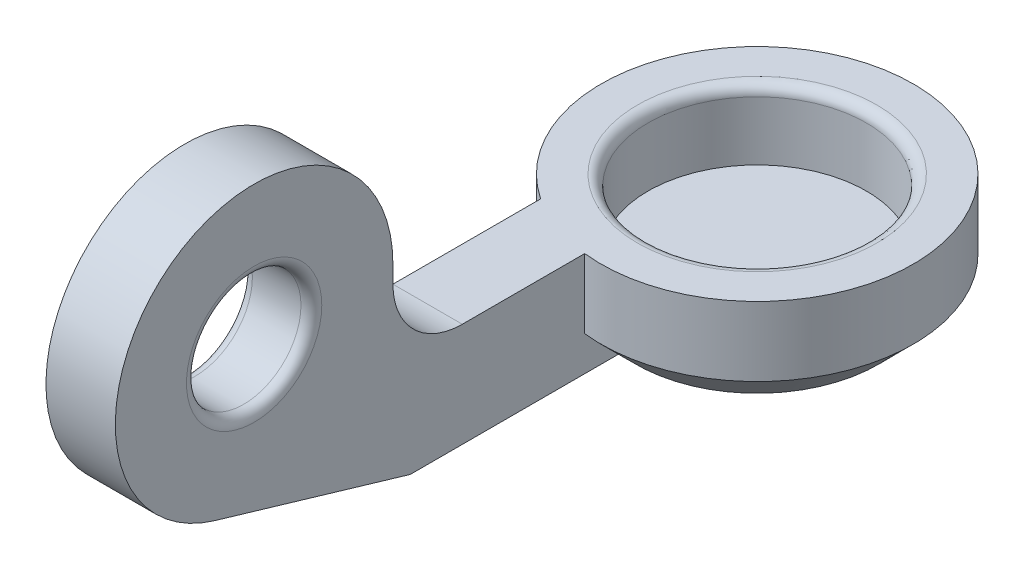
ISO-10303-21;
HEADER;
FILE_DESCRIPTION(('STEP AP214'),'2;1');
FILE_NAME('part.step','',(''),(''),'','','');
FILE_SCHEMA(('AUTOMOTIVE_DESIGN { 1 0 10303 214 1 1 1 1 }'));
ENDSEC;
DATA;
#1=APPLICATION_CONTEXT('core data for automotive mechanical design processes');
#2=APPLICATION_PROTOCOL_DEFINITION('international standard','automotive_design',2000,#1);
#3=PRODUCT_CONTEXT('',#1,'mechanical');
#4=PRODUCT('Part','Part','',(#3));
#5=PRODUCT_RELATED_PRODUCT_CATEGORY('part','',(#4));
#6=PRODUCT_DEFINITION_FORMATION('','',#4);
#7=PRODUCT_DEFINITION_CONTEXT('part definition',#1,'design');
#8=PRODUCT_DEFINITION('design','',#6,#7);
#9=PRODUCT_DEFINITION_SHAPE('','',#8);
#10=(LENGTH_UNIT() NAMED_UNIT(*) SI_UNIT(.MILLI.,.METRE.));
#11=(NAMED_UNIT(*) PLANE_ANGLE_UNIT() SI_UNIT($,.RADIAN.));
#12=(NAMED_UNIT(*) SI_UNIT($,.STERADIAN.) SOLID_ANGLE_UNIT());
#13=UNCERTAINTY_MEASURE_WITH_UNIT(LENGTH_MEASURE(1.E-05),#10,'distance_accuracy_value','');
#14=(GEOMETRIC_REPRESENTATION_CONTEXT(3) GLOBAL_UNCERTAINTY_ASSIGNED_CONTEXT((#13)) GLOBAL_UNIT_ASSIGNED_CONTEXT((#10,
#11,#12)) REPRESENTATION_CONTEXT('',''));
#15=CARTESIAN_POINT('',(0.,0.,0.));
#16=DIRECTION('',(0.,0.,1.));
#17=DIRECTION('',(1.,0.,0.));
#18=AXIS2_PLACEMENT_3D('',#15,#16,#17);
#19=CARTESIAN_POINT('',(0.,-2.,0.));
#20=DIRECTION('',(0.,1.,0.));
#21=DIRECTION('',(0.,0.,1.));
#22=AXIS2_PLACEMENT_3D('',#19,#20,#21);
#23=CONICAL_SURFACE('',#22,4.5,0.785398163397448);
#24=CARTESIAN_POINT('',(-0.5,1.84455672578068,-8.32956343092311));
#25=CARTESIAN_POINT('',(-0.5,1.56050708483777,-8.04499841482449));
#26=CARTESIAN_POINT('',(-0.5,1.27647978357437,-7.76041108292257));
#27=CARTESIAN_POINT('',(-0.5,0.708494530276033,-7.19115924221696));
#28=CARTESIAN_POINT('',(-0.5,0.424536579272096,-6.9064947323846));
#29=CARTESIAN_POINT('',(-0.5,-0.143366592922138,-6.33697445829595));
#30=CARTESIAN_POINT('',(-0.5,-0.427311782030489,-6.0521186620469));
#31=CARTESIAN_POINT('',(-0.5,-0.99504439296968,-5.48225763399936));
#32=CARTESIAN_POINT('',(-0.5,-1.27883181691005,-5.19725240430306));
#33=CARTESIAN_POINT('',(-0.5,-1.85350048784624,-4.61961401126448));
#34=CARTESIAN_POINT('',(-0.5,-2.14437521348103,-4.32697435992691));
#35=CARTESIAN_POINT('',(-0.5,-2.72568264848801,-3.74123232923193));
#36=CARTESIAN_POINT('',(-0.5,-3.01611533948948,-3.44812993162163));
#37=CARTESIAN_POINT('',(-0.5,-3.45101484407144,-3.00779367353851));
#38=CARTESIAN_POINT('',(-0.5,-3.5958419470033,-2.86091589775715));
#39=CARTESIAN_POINT('',(-0.5,-3.88511250907444,-2.5667782458169));
#40=CARTESIAN_POINT('',(-0.5,-4.02955596186184,-2.41951836341051));
#41=CARTESIAN_POINT('',(-0.5,-4.31779936005582,-2.12438992089171));
#42=CARTESIAN_POINT('',(-0.5,-4.46159935309042,-1.9765214074385));
#43=CARTESIAN_POINT('',(-0.5,-4.67638345410784,-1.75383844803434));
#44=CARTESIAN_POINT('',(-0.5,-4.7478245591479,-1.67946509501682));
#45=CARTESIAN_POINT('',(-0.5,-4.89025485207228,-1.53028723892495));
#46=CARTESIAN_POINT('',(-0.5,-4.96124404443078,-1.4554827401332));
#47=CARTESIAN_POINT('',(-0.5,-5.07000750791339,-1.33980093696933));
#48=CARTESIAN_POINT('',(-0.5,-5.10802939419686,-1.29915655648828));
#49=CARTESIAN_POINT('',(-0.5,-5.18380610610896,-1.21761815713421));
#50=CARTESIAN_POINT('',(-0.5,-5.22156092781463,-1.17672413461052));
#51=CARTESIAN_POINT('',(-0.5,-5.29663063086563,-1.09470121937531));
#52=CARTESIAN_POINT('',(-0.5,-5.33394630544709,-1.0535730536634));
#53=CARTESIAN_POINT('',(-0.5,-5.4080886195102,-0.970879040266312));
#54=CARTESIAN_POINT('',(-0.5,-5.44491527362126,-0.929313205741325));
#55=CARTESIAN_POINT('',(-0.5,-5.52762414048717,-0.834384107956916));
#56=CARTESIAN_POINT('',(-0.5,-5.57329582917367,-0.780837081168954));
#57=CARTESIAN_POINT('',(-0.5,-5.66298120195017,-0.671994253754087));
#58=CARTESIAN_POINT('',(-0.5,-5.70698786566927,-0.616692540626108));
#59=CARTESIAN_POINT('',(-0.5,-5.77053081956287,-0.531487144997089));
#60=CARTESIAN_POINT('',(-0.5,-5.79138824788977,-0.502575514403177));
#61=CARTESIAN_POINT('',(-0.5,-5.83179128884024,-0.4438042162966));
#62=CARTESIAN_POINT('',(-0.5,-5.85133580834869,-0.413943788558022));
#63=CARTESIAN_POINT('',(-0.5,-5.88834818027311,-0.353126256983285));
#64=CARTESIAN_POINT('',(-0.5,-5.90582507990371,-0.322174763370816));
#65=CARTESIAN_POINT('',(-0.5,-5.93768505638904,-0.258745893671859));
#66=CARTESIAN_POINT('',(-0.5,-5.95207398030669,-0.226271545814342));
#67=CARTESIAN_POINT('',(-0.5,-5.97621978956839,-0.159155788096467));
#68=CARTESIAN_POINT('',(-0.5,-5.98592616732087,-0.124495118782898));
#69=CARTESIAN_POINT('',(-0.5,-5.99825618722708,-0.0540707572158387));
#70=CARTESIAN_POINT('',(-0.5,-6.00092668456852,-0.0183159743105536));
#71=CARTESIAN_POINT('',(-0.5,-5.99847296288625,0.0529727404849206));
#72=CARTESIAN_POINT('',(-0.5,-5.99333303669486,0.0885060826566771));
#73=CARTESIAN_POINT('',(-0.5,-5.97668577394989,0.158195198760665));
#74=CARTESIAN_POINT('',(-0.5,-5.96513274108427,0.192339176893906));
#75=CARTESIAN_POINT('',(-0.5,-5.93480061320678,0.266130071703718));
#76=CARTESIAN_POINT('',(-0.5,-5.91499056608467,0.305333351929589));
#77=CARTESIAN_POINT('',(-0.5,-5.87173301819547,0.381718062786176));
#78=CARTESIAN_POINT('',(-0.5,-5.84827634554093,0.418894066949211));
#79=CARTESIAN_POINT('',(-0.5,-5.79904777256703,0.492002214262168));
#80=CARTESIAN_POINT('',(-0.5,-5.77326208689647,0.527924934770371));
#81=CARTESIAN_POINT('',(-0.5,-5.72034083480357,0.598677113662614));
#82=CARTESIAN_POINT('',(-0.5,-5.693207038772,0.633507912775811));
#83=CARTESIAN_POINT('',(-0.5,-5.61526342578271,0.730888910563142));
#84=CARTESIAN_POINT('',(-0.5,-5.56339737759493,0.792588848604165));
#85=CARTESIAN_POINT('',(-0.5,-5.45807538778561,0.914622329290568));
#86=CARTESIAN_POINT('',(-0.5,-5.40461902580731,0.974955503110521));
#87=CARTESIAN_POINT('',(-0.5,-5.29669100088894,1.09482119858602));
#88=CARTESIAN_POINT('',(-0.5,-5.2422183237578,1.15435280578165));
#89=CARTESIAN_POINT('',(-0.5,-5.1326630069678,1.27283652130572));
#90=CARTESIAN_POINT('',(-0.5,-5.07758044090649,1.33178869796985));
#91=CARTESIAN_POINT('',(-0.5,-4.91224351989638,1.50750201236674));
#92=CARTESIAN_POINT('',(-0.5,-4.80137950667479,1.62368876701915));
#93=CARTESIAN_POINT('',(-0.5,-4.57886581880136,1.85519380298763));
#94=CARTESIAN_POINT('',(-0.5,-4.46721655566742,1.97051248189618));
#95=CARTESIAN_POINT('',(-0.5,-4.20942801301285,2.23561094395497));
#96=CARTESIAN_POINT('',(-0.5,-4.06311268923825,2.3852194961621));
#97=CARTESIAN_POINT('',(-0.5,-3.76998412402506,2.68399035736643));
#98=CARTESIAN_POINT('',(-0.5,-3.62317081235265,2.83315259731562));
#99=CARTESIAN_POINT('',(-0.5,-3.32909014568224,3.1313379525699));
#100=CARTESIAN_POINT('',(-0.5,-3.18182247577289,3.28036075725725));
#101=CARTESIAN_POINT('',(-0.5,-2.88709482362797,3.57820377206648));
#102=CARTESIAN_POINT('',(-0.5,-2.73963484959933,3.72702399031365));
#103=CARTESIAN_POINT('',(-0.5,-2.42510048872422,4.0441650280635));
#104=CARTESIAN_POINT('',(-0.5,-2.25800665731583,4.21246656038625));
#105=CARTESIAN_POINT('',(-0.5,-1.92369386295978,4.54894917647072));
#106=CARTESIAN_POINT('',(-0.5,-1.75647489857406,4.71713025880332));
#107=CARTESIAN_POINT('',(-0.5,-1.25481985182567,5.22140770810821));
#108=CARTESIAN_POINT('',(-0.5,-0.920251946824391,5.55737292667038));
#109=CARTESIAN_POINT('',(-0.5,-0.185731867548644,6.29453206406151));
#110=CARTESIAN_POINT('',(-0.5,0.214262034476446,6.69568438979152));
#111=CARTESIAN_POINT('',(-0.5,1.01459926683641,7.49799356471106));
#112=CARTESIAN_POINT('',(-0.5,1.41494267347706,7.89915033778905));
#113=CARTESIAN_POINT('',(-0.5,1.81531964439593,8.30027353696713));
#114=B_SPLINE_CURVE_WITH_KNOTS('',3,(#24,#25,#26,#27,#28,#29,#30,#31,#32,#33,#34,#35,#36,#37,
#38,#39,#40,#41,#42,#43,#44,#45,#46,#47,#48,#49,#50,#51,#52,#53,#54,#55,#56,#57,#58,#59,#60,#61,
#62,#63,#64,#65,#66,#67,#68,#69,#70,#71,#72,#73,#74,#75,#76,#77,#78,#79,#80,#81,#82,#83,#84,#85,
#86,#87,#88,#89,#90,#91,#92,#93,#94,#95,#96,#97,#98,#99,#100,#101,#102,#103,#104,#105,#106,#107,
#108,#109,#110,#111,#112,#113),.UNSPECIFIED.,.F.,.F.,(4,2,2,2,2,2,2,2,2,2,2,2,2,2,2,2,2,2,2,2,2,
2,2,2,2,2,2,2,2,2,2,2,2,2,2,2,2,2,2,2,2,2,2,2,4),(0.,1.20621435242465,2.41244566123549,
3.61905627978482,4.82565035643883,6.06347679806063,7.30135335025228,7.92016760723653,
8.53899204649839,9.15776989730009,9.46715056596943,9.77652816681766,9.94349636452863,
10.1104670098003,10.2770653596704,10.4436587143424,10.6547799123228,10.8667097318165,
10.9736349158873,11.0806480488248,11.1871741029436,11.2934966353278,11.4009416903207,
11.5076693888429,11.6146120065518,11.7223266062877,11.853757802166,11.9855250840214,
12.1181310144811,12.2505671816149,12.4923168125491,12.7341309214143,12.9762008266608,
13.2182418320816,13.700011127738,14.1815443966626,14.8093301583688,15.4372084829039,
16.0657461983655,16.6942579145561,17.4057434372674,18.1172372661971,19.5396557314697,
21.2391452464389,22.9393846734594),.UNSPECIFIED.);
#115=CARTESIAN_POINT('',(-0.5,-3.,3.46410161513775));
#116=VERTEX_POINT('',#115);
#117=CARTESIAN_POINT('',(-0.5,-2.,4.47213595499958));
#118=VERTEX_POINT('',#117);
#119=EDGE_CURVE('E196',#116,#118,#114,.T.);
#120=ORIENTED_EDGE('',*,*,#119,.F.);
#121=CARTESIAN_POINT('',(0.,-3.,0.));
#122=DIRECTION('',(0.,1.,0.));
#123=DIRECTION('',(0.,0.,1.));
#124=AXIS2_PLACEMENT_3D('',#121,#122,#123);
#125=CIRCLE('',#124,3.5);
#126=CARTESIAN_POINT('',(-2.5,-3.,2.44948974278318));
#127=VERTEX_POINT('',#126);
#128=EDGE_CURVE('E170',#116,#127,#125,.T.);
#129=ORIENTED_EDGE('',*,*,#128,.T.);
#130=CARTESIAN_POINT('',(-2.5,2.62537239341259,-8.77624186759097));
#131=CARTESIAN_POINT('',(-2.5,2.45532686204164,-8.59942389655475));
#132=CARTESIAN_POINT('',(-2.5,2.28547397593831,-8.42242013726825));
#133=CARTESIAN_POINT('',(-2.5,1.94624926182495,-8.0679493474952));
#134=CARTESIAN_POINT('',(-2.5,1.77687743805998,-7.89048231294689));
#135=CARTESIAN_POINT('',(-2.5,1.43866067607728,-7.53494073884856));
#136=CARTESIAN_POINT('',(-2.5,1.26981591941549,-7.35686602649842));
#137=CARTESIAN_POINT('',(-2.5,0.932841839792324,-7.00004182107414));
#138=CARTESIAN_POINT('',(-2.5,0.764712514228827,-6.82129233045872));
#139=CARTESIAN_POINT('',(-2.5,0.430766547477874,-6.46447546975868));
#140=CARTESIAN_POINT('',(-2.5,0.264942380185847,-6.286415148316));
#141=CARTESIAN_POINT('',(-2.5,-0.0655927638383192,-5.92926454193018));
#142=CARTESIAN_POINT('',(-2.5,-0.230303745247746,-5.75017426132048));
#143=CARTESIAN_POINT('',(-2.5,-0.558263151063855,-5.39070085892808));
#144=CARTESIAN_POINT('',(-2.5,-0.721511763612765,-5.21031790898999));
#145=CARTESIAN_POINT('',(-2.5,-1.04609776936607,-4.84784273816462));
#146=CARTESIAN_POINT('',(-2.5,-1.2074352023583,-4.66575055300296));
#147=CARTESIAN_POINT('',(-2.5,-1.48404599494157,-4.3490238571088));
#148=CARTESIAN_POINT('',(-2.5,-1.59993366034814,-4.21492644916895));
#149=CARTESIAN_POINT('',(-2.5,-1.82992756674574,-3.94519341122693));
#150=CARTESIAN_POINT('',(-2.5,-1.94403368734428,-3.80955767832861));
#151=CARTESIAN_POINT('',(-2.5,-2.17049957995706,-3.53561211597668));
#152=CARTESIAN_POINT('',(-2.5,-2.2828468187155,-3.39729189365955));
#153=CARTESIAN_POINT('',(-2.5,-2.50432038039213,-3.11812233830049));
#154=CARTESIAN_POINT('',(-2.5,-2.61344724512665,-2.9772734371875));
#155=CARTESIAN_POINT('',(-2.5,-2.82817074901362,-2.69098375461344));
#156=CARTESIAN_POINT('',(-2.5,-2.93372876691941,-2.54551382405584));
#157=CARTESIAN_POINT('',(-2.5,-3.13838703401993,-2.24985681163713));
#158=CARTESIAN_POINT('',(-2.5,-3.23748171553703,-2.09966582374475));
#159=CARTESIAN_POINT('',(-2.5,-3.4252732208908,-1.79400530737046));
#160=CARTESIAN_POINT('',(-2.5,-3.51402525687041,-1.63857011748645));
#161=CARTESIAN_POINT('',(-2.5,-3.67625211618313,-1.31995606951551));
#162=CARTESIAN_POINT('',(-2.5,-3.74975772041651,-1.15679364679773));
#163=CARTESIAN_POINT('',(-2.5,-3.83884070532115,-0.914632875530704));
#164=CARTESIAN_POINT('',(-2.5,-3.86393646429119,-0.83914148757603));
#165=CARTESIAN_POINT('',(-2.5,-3.90848771122169,-0.686489202153973));
#166=CARTESIAN_POINT('',(-2.5,-3.92794338394794,-0.609328359465924));
#167=CARTESIAN_POINT('',(-2.5,-3.96026154184952,-0.453897392597565));
#168=CARTESIAN_POINT('',(-2.5,-3.97314663196761,-0.375632036741169));
#169=CARTESIAN_POINT('',(-2.5,-3.99170800593505,-0.21824406017463));
#170=CARTESIAN_POINT('',(-2.5,-3.99738501867,-0.139121526959008));
#171=CARTESIAN_POINT('',(-2.5,-4.00119023636275,0.0197496047483457));
#172=CARTESIAN_POINT('',(-2.5,-3.99927622884941,0.0994992360076441));
#173=CARTESIAN_POINT('',(-2.5,-3.98792693941288,0.258456175830423));
#174=CARTESIAN_POINT('',(-2.5,-3.97849119012075,0.337663450385709));
#175=CARTESIAN_POINT('',(-2.5,-3.95262595988836,0.495147110585215));
#176=CARTESIAN_POINT('',(-2.5,-3.93617612628186,0.573420100386687));
#177=CARTESIAN_POINT('',(-2.5,-3.89712240856814,0.72842629456631));
#178=CARTESIAN_POINT('',(-2.5,-3.87451579881143,0.805158800768309));
#179=CARTESIAN_POINT('',(-2.5,-3.81383108482149,0.987746946736327));
#180=CARTESIAN_POINT('',(-2.5,-3.77320039781125,1.09275012656053));
#181=CARTESIAN_POINT('',(-2.5,-3.68404978504835,1.29933589908505));
#182=CARTESIAN_POINT('',(-2.5,-3.63552596619295,1.40091677381601));
#183=CARTESIAN_POINT('',(-2.5,-3.5324276106022,1.60121005826891));
#184=CARTESIAN_POINT('',(-2.5,-3.47784000593763,1.6999156707114));
#185=CARTESIAN_POINT('',(-2.5,-3.36416856068681,1.89464390025878));
#186=CARTESIAN_POINT('',(-2.5,-3.3050858396643,1.99066717733951));
#187=CARTESIAN_POINT('',(-2.5,-3.1495554604418,2.2334792524369));
#188=CARTESIAN_POINT('',(-2.5,-3.05065699098487,2.37869190466841));
#189=CARTESIAN_POINT('',(-2.5,-2.8472198362771,2.6651314028905));
#190=CARTESIAN_POINT('',(-2.5,-2.74267921630092,2.80635685603766));
#191=CARTESIAN_POINT('',(-2.5,-2.52952235646906,3.08591507615983));
#192=CARTESIAN_POINT('',(-2.5,-2.42090201378568,3.22424470076945));
#193=CARTESIAN_POINT('',(-2.5,-2.20076719402405,3.49858408373473));
#194=CARTESIAN_POINT('',(-2.5,-2.08925254686146,3.63459370497308));
#195=CARTESIAN_POINT('',(-2.5,-1.86388814878397,3.90501260292795));
#196=CARTESIAN_POINT('',(-2.5,-1.75003508548807,4.03941911200735));
#197=CARTESIAN_POINT('',(-2.5,-1.52065803564957,4.30680232898979));
#198=CARTESIAN_POINT('',(-2.5,-1.4051339996097,4.43977899433399));
#199=CARTESIAN_POINT('',(-2.5,-1.05677810194326,4.836828106147));
#200=CARTESIAN_POINT('',(-2.5,-0.822010003706293,5.09920042636675));
#201=CARTESIAN_POINT('',(-2.5,-0.357579597979248,5.61164109003173));
#202=CARTESIAN_POINT('',(-2.5,-0.12803306236707,5.86181493358573));
#203=CARTESIAN_POINT('',(-2.5,0.333262079894573,6.36021736148205));
#204=CARTESIAN_POINT('',(-2.5,0.565011127765062,6.60844553707359));
#205=CARTESIAN_POINT('',(-2.5,1.02860577757195,7.10190290541815));
#206=CARTESIAN_POINT('',(-2.5,1.26044176562337,7.34714114681969));
#207=CARTESIAN_POINT('',(-2.5,1.72522369193856,7.83645198023402));
#208=CARTESIAN_POINT('',(-2.5,1.95816935002065,8.08052483825432));
#209=CARTESIAN_POINT('',(-2.5,2.19151702101936,8.32420975989128));
#210=B_SPLINE_CURVE_WITH_KNOTS('',3,(#130,#131,#132,#133,#134,#135,#136,#137,#138,#139,#140,
#141,#142,#143,#144,#145,#146,#147,#148,#149,#150,#151,#152,#153,#154,#155,#156,#157,#158,#159,
#160,#161,#162,#163,#164,#165,#166,#167,#168,#169,#170,#171,#172,#173,#174,#175,#176,#177,#178,
#179,#180,#181,#182,#183,#184,#185,#186,#187,#188,#189,#190,#191,#192,#193,#194,#195,#196,#197,
#198,#199,#200,#201,#202,#203,#204,#205,#206,#207,#208,#209),.UNSPECIFIED.,.F.,.F.,(4,2,2,2,2,2,
2,2,2,2,2,2,2,2,2,2,2,2,2,2,2,2,2,2,2,2,2,2,2,2,2,2,2,2,2,2,2,2,2,4),(0.,0.735949258687007,
1.47190499160842,2.20809113399568,2.94427459648893,3.67422178378698,4.4041659021477,
5.13401471980858,5.8638483163357,6.39554008686045,6.92726763365697,7.46182634222686,
7.99629459443896,8.53537806862466,9.07491995126682,9.61143506907622,10.1468562450731,
10.385340198542,10.6238163385383,10.861466412123,11.0990924524591,11.3380417415312,
11.5770058790497,11.8166681852488,12.0564367646467,12.3937545516366,12.7312392200414,
13.0694658462401,13.407608507002,13.9344654352589,14.4615041879956,14.9890879543799,
15.516702794836,16.0451250757079,16.5735630416013,17.6297297364615,18.648296684882,
19.6670721704672,20.6794947128856,21.6916739092562),.UNSPECIFIED.);
#211=CARTESIAN_POINT('',(-2.5,-2.,3.74165738677394));
#212=VERTEX_POINT('',#211);
#213=EDGE_CURVE('E186',#127,#212,#210,.T.);
#214=ORIENTED_EDGE('',*,*,#213,.T.);
#215=CARTESIAN_POINT('',(0.,-2.,0.));
#216=DIRECTION('',(0.,1.,0.));
#217=DIRECTION('',(0.,0.,1.));
#218=AXIS2_PLACEMENT_3D('',#215,#216,#217);
#219=CIRCLE('',#218,4.5);
#220=EDGE_CURVE('E174',#118,#212,#219,.T.);
#221=ORIENTED_EDGE('',*,*,#220,.F.);
#222=EDGE_LOOP('',(#120,#129,#214,#221));
#223=FACE_BOUND('',#222,.T.);
#224=ADVANCED_FACE('F43',(#223),#23,.T.);
#225=CARTESIAN_POINT('',(0.,-3.,0.));
#226=DIRECTION('',(0.,1.,0.));
#227=DIRECTION('',(0.,0.,1.));
#228=AXIS2_PLACEMENT_3D('',#225,#226,#227);
#229=CYLINDRICAL_SURFACE('',#228,4.5);
#230=DIRECTION('',(0.,1.,0.));
#231=VECTOR('',#230,1.);
#232=CARTESIAN_POINT('',(-0.5,-3.,4.47213595499958));
#233=LINE('',#232,#231);
#234=CARTESIAN_POINT('',(-0.5,0.,4.47213595499958));
#235=VERTEX_POINT('',#234);
#236=EDGE_CURVE('E166',#118,#235,#233,.T.);
#237=ORIENTED_EDGE('',*,*,#236,.F.);
#238=ORIENTED_EDGE('',*,*,#220,.T.);
#239=DIRECTION('',(0.,1.,0.));
#240=VECTOR('',#239,1.);
#241=CARTESIAN_POINT('',(-2.5,-3.,3.74165738677394));
#242=LINE('',#241,#240);
#243=CARTESIAN_POINT('',(-2.5,0.,3.74165738677394));
#244=VERTEX_POINT('',#243);
#245=EDGE_CURVE('E162',#212,#244,#242,.T.);
#246=ORIENTED_EDGE('',*,*,#245,.T.);
#247=CARTESIAN_POINT('',(0.,0.,0.));
#248=DIRECTION('',(0.,1.,0.));
#249=DIRECTION('',(0.,0.,1.));
#250=AXIS2_PLACEMENT_3D('',#247,#248,#249);
#251=CIRCLE('',#250,4.5);
#252=EDGE_CURVE('E182',#235,#244,#251,.T.);
#253=ORIENTED_EDGE('',*,*,#252,.F.);
#254=EDGE_LOOP('',(#237,#238,#246,#253));
#255=FACE_BOUND('',#254,.T.);
#256=ADVANCED_FACE('F227',(#255),#229,.T.);
#257=CARTESIAN_POINT('',(0.,0.,0.));
#258=DIRECTION('',(0.,1.,0.));
#259=DIRECTION('',(0.,0.,1.));
#260=AXIS2_PLACEMENT_3D('',#257,#258,#259);
#261=PLANE('',#260);
#262=CARTESIAN_POINT('',(0.,0.,0.));
#263=DIRECTION('',(0.,1.,0.));
#264=DIRECTION('',(0.,0.,1.));
#265=AXIS2_PLACEMENT_3D('',#262,#263,#264);
#266=CIRCLE('',#265,3.45);
#267=CARTESIAN_POINT('',(0.,0.,3.45));
#268=VERTEX_POINT('',#267);
#269=EDGE_CURVE('E253',#268,#268,#266,.F.);
#270=ORIENTED_EDGE('',*,*,#269,.T.);
#271=EDGE_LOOP('',(#270));
#272=FACE_BOUND('',#271,.T.);
#273=DIRECTION('',(0.,0.,1.));
#274=VECTOR('',#273,1.);
#275=CARTESIAN_POINT('',(-2.5,0.,3.74165738677394));
#276=LINE('',#275,#274);
#277=CARTESIAN_POINT('',(-2.5,0.,8.));
#278=VERTEX_POINT('',#277);
#279=EDGE_CURVE('E122',#244,#278,#276,.T.);
#280=ORIENTED_EDGE('',*,*,#279,.T.);
#281=DIRECTION('',(-1.,0.,0.));
#282=VECTOR('',#281,1.);
#283=CARTESIAN_POINT('',(0.,0.,8.));
#284=LINE('',#283,#282);
#285=CARTESIAN_POINT('',(-0.5,0.,8.));
#286=VERTEX_POINT('',#285);
#287=EDGE_CURVE('E66',#278,#286,#284,.F.);
#288=ORIENTED_EDGE('',*,*,#287,.T.);
#289=DIRECTION('',(0.,0.,1.));
#290=VECTOR('',#289,1.);
#291=CARTESIAN_POINT('',(-0.5,0.,3.74165738677394));
#292=LINE('',#291,#290);
#293=EDGE_CURVE('E138',#235,#286,#292,.T.);
#294=ORIENTED_EDGE('',*,*,#293,.F.);
#295=ORIENTED_EDGE('',*,*,#252,.T.);
#296=EDGE_LOOP('',(#280,#288,#294,#295));
#297=FACE_BOUND('',#296,.T.);
#298=ADVANCED_FACE('F232',(#272,#297),#261,.T.);
#299=CARTESIAN_POINT('',(0.,-2.,0.));
#300=DIRECTION('',(0.,1.,0.));
#301=DIRECTION('',(0.,0.,1.));
#302=AXIS2_PLACEMENT_3D('',#299,#300,#301);
#303=CYLINDRICAL_SURFACE('',#302,3.15);
#304=CARTESIAN_POINT('',(0.,-0.3,0.));
#305=DIRECTION('',(0.,1.,0.));
#306=DIRECTION('',(0.,0.,1.));
#307=AXIS2_PLACEMENT_3D('',#304,#305,#306);
#308=CIRCLE('',#307,3.15);
#309=CARTESIAN_POINT('',(0.,-0.3,3.15));
#310=VERTEX_POINT('',#309);
#311=EDGE_CURVE('E248',#310,#310,#308,.T.);
#312=ORIENTED_EDGE('',*,*,#311,.T.);
#313=EDGE_LOOP('',(#312));
#314=FACE_BOUND('',#313,.T.);
#315=CARTESIAN_POINT('',(0.,-2.,0.));
#316=DIRECTION('',(0.,1.,0.));
#317=DIRECTION('',(0.,0.,1.));
#318=AXIS2_PLACEMENT_3D('',#315,#316,#317);
#319=CIRCLE('',#318,3.15);
#320=CARTESIAN_POINT('',(0.,-2.,3.15));
#321=VERTEX_POINT('',#320);
#322=EDGE_CURVE('E178',#321,#321,#319,.T.);
#323=ORIENTED_EDGE('',*,*,#322,.F.);
#324=EDGE_LOOP('',(#323));
#325=FACE_BOUND('',#324,.T.);
#326=ADVANCED_FACE('F346',(#314,#325),#303,.F.);
#327=CARTESIAN_POINT('',(0.,-2.,0.));
#328=DIRECTION('',(0.,1.,0.));
#329=DIRECTION('',(0.,0.,1.));
#330=AXIS2_PLACEMENT_3D('',#327,#328,#329);
#331=PLANE('',#330);
#332=ORIENTED_EDGE('',*,*,#322,.T.);
#333=EDGE_LOOP('',(#332));
#334=FACE_BOUND('',#333,.T.);
#335=ADVANCED_FACE('F222',(#334),#331,.T.);
#336=CARTESIAN_POINT('',(0.,-3.,0.));
#337=DIRECTION('',(0.,1.,0.));
#338=DIRECTION('',(0.,0.,1.));
#339=AXIS2_PLACEMENT_3D('',#336,#337,#338);
#340=PLANE('',#339);
#341=ORIENTED_EDGE('',*,*,#128,.F.);
#342=DIRECTION('',(0.,0.,-1.));
#343=VECTOR('',#342,1.);
#344=CARTESIAN_POINT('',(-0.5,-3.,3.5));
#345=LINE('',#344,#343);
#346=CARTESIAN_POINT('',(-0.5,-3.,9.5));
#347=VERTEX_POINT('',#346);
#348=EDGE_CURVE('E142',#347,#116,#345,.T.);
#349=ORIENTED_EDGE('',*,*,#348,.F.);
#350=DIRECTION('',(1.,0.,0.));
#351=VECTOR('',#350,1.);
#352=CARTESIAN_POINT('',(-15.3677365165916,-3.,9.5));
#353=LINE('',#352,#351);
#354=CARTESIAN_POINT('',(-2.5,-3.,9.5));
#355=VERTEX_POINT('',#354);
#356=EDGE_CURVE('E151',#355,#347,#353,.T.);
#357=ORIENTED_EDGE('',*,*,#356,.F.);
#358=DIRECTION('',(0.,0.,1.));
#359=VECTOR('',#358,1.);
#360=CARTESIAN_POINT('',(-2.5,-3.,3.5));
#361=LINE('',#360,#359);
#362=EDGE_CURVE('E150',#127,#355,#361,.T.);
#363=ORIENTED_EDGE('',*,*,#362,.F.);
#364=EDGE_LOOP('',(#341,#349,#357,#363));
#365=FACE_BOUND('',#364,.T.);
#366=ADVANCED_FACE('F217',(#365),#340,.F.);
#367=CARTESIAN_POINT('',(-15.3677365165916,-3.,9.5));
#368=DIRECTION('',(0.,-0.959039906535825,0.283270996877119));
#369=DIRECTION('',(0.,-0.283270996877119,-0.959039906535825));
#370=AXIS2_PLACEMENT_3D('',#367,#368,#369);
#371=PLANE('',#370);
#372=DIRECTION('',(0.,0.283270996877119,0.959039906535825));
#373=VECTOR('',#372,1.);
#374=CARTESIAN_POINT('',(-2.5,-3.,9.5));
#375=LINE('',#374,#373);
#376=CARTESIAN_POINT('',(-2.5,-1.3361596261433,15.1330839875085));
#377=VERTEX_POINT('',#376);
#378=EDGE_CURVE('E146',#355,#377,#375,.T.);
#379=ORIENTED_EDGE('',*,*,#378,.F.);
#380=ORIENTED_EDGE('',*,*,#356,.T.);
#381=DIRECTION('',(0.,-0.283270996877119,-0.959039906535825));
#382=VECTOR('',#381,1.);
#383=CARTESIAN_POINT('',(-0.5,-3.,9.5));
#384=LINE('',#383,#382);
#385=CARTESIAN_POINT('',(-0.5,-1.3361596261433,15.1330839875085));
#386=VERTEX_POINT('',#385);
#387=EDGE_CURVE('E132',#386,#347,#384,.T.);
#388=ORIENTED_EDGE('',*,*,#387,.F.);
#389=DIRECTION('',(1.,0.,0.));
#390=VECTOR('',#389,1.);
#391=CARTESIAN_POINT('',(-15.3677365165916,-1.3361596261433,15.1330839875085));
#392=LINE('',#391,#390);
#393=EDGE_CURVE('E131',#377,#386,#392,.T.);
#394=ORIENTED_EDGE('',*,*,#393,.F.);
#395=EDGE_LOOP('',(#379,#380,#388,#394));
#396=FACE_BOUND('',#395,.T.);
#397=ADVANCED_FACE('F214',(#396),#371,.T.);
#398=CARTESIAN_POINT('',(-0.5,0.,0.));
#399=DIRECTION('',(1.,0.,0.));
#400=DIRECTION('',(0.,0.,-1.));
#401=AXIS2_PLACEMENT_3D('',#398,#399,#400);
#402=PLANE('',#401);
#403=CARTESIAN_POINT('',(-0.5,2.5,14.));
#404=DIRECTION('',(1.,0.,0.));
#405=DIRECTION('',(0.,0.,-1.));
#406=AXIS2_PLACEMENT_3D('',#403,#404,#405);
#407=CIRCLE('',#406,1.95);
#408=CARTESIAN_POINT('',(-0.5,2.5,12.05));
#409=VERTEX_POINT('',#408);
#410=EDGE_CURVE('E265',#409,#409,#407,.F.);
#411=ORIENTED_EDGE('',*,*,#410,.T.);
#412=EDGE_LOOP('',(#411));
#413=FACE_BOUND('',#412,.T.);
#414=ORIENTED_EDGE('',*,*,#293,.T.);
#415=CARTESIAN_POINT('',(-0.5,2.,8.));
#416=DIRECTION('',(1.,0.,0.));
#417=DIRECTION('',(0.,0.,-1.));
#418=AXIS2_PLACEMENT_3D('',#415,#416,#417);
#419=CIRCLE('',#418,2.);
#420=CARTESIAN_POINT('',(-0.5,2.,10.));
#421=VERTEX_POINT('',#420);
#422=EDGE_CURVE('E117',#286,#421,#419,.F.);
#423=ORIENTED_EDGE('',*,*,#422,.T.);
#424=DIRECTION('',(0.,1.,0.));
#425=VECTOR('',#424,1.);
#426=CARTESIAN_POINT('',(-0.5,0.,10.));
#427=LINE('',#426,#425);
#428=CARTESIAN_POINT('',(-0.5,2.5,10.));
#429=VERTEX_POINT('',#428);
#430=EDGE_CURVE('E109',#421,#429,#427,.T.);
#431=ORIENTED_EDGE('',*,*,#430,.T.);
#432=CARTESIAN_POINT('',(-0.5,2.5,14.));
#433=DIRECTION('',(1.,0.,0.));
#434=DIRECTION('',(0.,0.,-1.));
#435=AXIS2_PLACEMENT_3D('',#432,#433,#434);
#436=CIRCLE('',#435,4.);
#437=EDGE_CURVE('E114',#429,#386,#436,.T.);
#438=ORIENTED_EDGE('',*,*,#437,.T.);
#439=ORIENTED_EDGE('',*,*,#387,.T.);
#440=ORIENTED_EDGE('',*,*,#348,.T.);
#441=ORIENTED_EDGE('',*,*,#119,.T.);
#442=ORIENTED_EDGE('',*,*,#236,.T.);
#443=EDGE_LOOP('',(#414,#423,#431,#438,#439,#440,#441,#442));
#444=FACE_BOUND('',#443,.T.);
#445=ADVANCED_FACE('F111',(#413,#444),#402,.T.);
#446=CARTESIAN_POINT('',(-2.5,2.5,14.));
#447=DIRECTION('',(1.,0.,0.));
#448=DIRECTION('',(0.,0.,-1.));
#449=AXIS2_PLACEMENT_3D('',#446,#447,#448);
#450=PLANE('',#449);
#451=CARTESIAN_POINT('',(-2.5,2.5,14.));
#452=DIRECTION('',(1.,0.,0.));
#453=DIRECTION('',(0.,0.,-1.));
#454=AXIS2_PLACEMENT_3D('',#451,#452,#453);
#455=CIRCLE('',#454,1.95);
#456=CARTESIAN_POINT('',(-2.5,2.5,12.05));
#457=VERTEX_POINT('',#456);
#458=EDGE_CURVE('E52',#457,#457,#455,.T.);
#459=ORIENTED_EDGE('',*,*,#458,.T.);
#460=EDGE_LOOP('',(#459));
#461=FACE_BOUND('',#460,.T.);
#462=CARTESIAN_POINT('',(-2.5,2.5,14.));
#463=DIRECTION('',(1.,0.,0.));
#464=DIRECTION('',(0.,0.,-1.));
#465=AXIS2_PLACEMENT_3D('',#462,#463,#464);
#466=CIRCLE('',#465,4.);
#467=CARTESIAN_POINT('',(-2.5,2.5,10.));
#468=VERTEX_POINT('',#467);
#469=EDGE_CURVE('E137',#468,#377,#466,.T.);
#470=ORIENTED_EDGE('',*,*,#469,.F.);
#471=DIRECTION('',(0.,1.,0.));
#472=VECTOR('',#471,1.);
#473=CARTESIAN_POINT('',(-2.5,0.,10.));
#474=LINE('',#473,#472);
#475=CARTESIAN_POINT('',(-2.5,2.,10.));
#476=VERTEX_POINT('',#475);
#477=EDGE_CURVE('E127',#476,#468,#474,.T.);
#478=ORIENTED_EDGE('',*,*,#477,.F.);
#479=CARTESIAN_POINT('',(-2.5,2.,8.));
#480=DIRECTION('',(1.,0.,0.));
#481=DIRECTION('',(0.,0.,-1.));
#482=AXIS2_PLACEMENT_3D('',#479,#480,#481);
#483=CIRCLE('',#482,2.);
#484=EDGE_CURVE('E59',#476,#278,#483,.T.);
#485=ORIENTED_EDGE('',*,*,#484,.T.);
#486=ORIENTED_EDGE('',*,*,#279,.F.);
#487=ORIENTED_EDGE('',*,*,#245,.F.);
#488=ORIENTED_EDGE('',*,*,#213,.F.);
#489=ORIENTED_EDGE('',*,*,#362,.T.);
#490=ORIENTED_EDGE('',*,*,#378,.T.);
#491=EDGE_LOOP('',(#470,#478,#485,#486,#487,#488,#489,#490));
#492=FACE_BOUND('',#491,.T.);
#493=ADVANCED_FACE('F206',(#461,#492),#450,.F.);
#494=CARTESIAN_POINT('',(-2.5,2.5,14.));
#495=DIRECTION('',(1.,0.,0.));
#496=DIRECTION('',(0.,0.,-1.));
#497=AXIS2_PLACEMENT_3D('',#494,#495,#496);
#498=CYLINDRICAL_SURFACE('',#497,4.);
#499=ORIENTED_EDGE('',*,*,#469,.T.);
#500=ORIENTED_EDGE('',*,*,#393,.T.);
#501=ORIENTED_EDGE('',*,*,#437,.F.);
#502=DIRECTION('',(1.,0.,0.));
#503=VECTOR('',#502,1.);
#504=CARTESIAN_POINT('',(-15.3677365165916,2.5,10.));
#505=LINE('',#504,#503);
#506=EDGE_CURVE('E125',#468,#429,#505,.T.);
#507=ORIENTED_EDGE('',*,*,#506,.F.);
#508=EDGE_LOOP('',(#499,#500,#501,#507));
#509=FACE_BOUND('',#508,.T.);
#510=ADVANCED_FACE('F134',(#509),#498,.T.);
#511=CARTESIAN_POINT('',(-2.5,2.5,14.));
#512=DIRECTION('',(1.,0.,0.));
#513=DIRECTION('',(0.,0.,-1.));
#514=AXIS2_PLACEMENT_3D('',#511,#512,#513);
#515=CYLINDRICAL_SURFACE('',#514,1.65);
#516=CARTESIAN_POINT('',(-2.2,2.5,14.));
#517=DIRECTION('',(1.,0.,0.));
#518=DIRECTION('',(0.,0.,-1.));
#519=AXIS2_PLACEMENT_3D('',#516,#517,#518);
#520=CIRCLE('',#519,1.65);
#521=CARTESIAN_POINT('',(-2.2,2.5,12.35));
#522=VERTEX_POINT('',#521);
#523=EDGE_CURVE('E12',#522,#522,#520,.F.);
#524=ORIENTED_EDGE('',*,*,#523,.T.);
#525=EDGE_LOOP('',(#524));
#526=FACE_BOUND('',#525,.T.);
#527=CARTESIAN_POINT('',(-0.8,2.5,14.));
#528=DIRECTION('',(1.,0.,0.));
#529=DIRECTION('',(0.,0.,-1.));
#530=AXIS2_PLACEMENT_3D('',#527,#528,#529);
#531=CIRCLE('',#530,1.65);
#532=CARTESIAN_POINT('',(-0.8,2.5,12.35));
#533=VERTEX_POINT('',#532);
#534=EDGE_CURVE('E261',#533,#533,#531,.T.);
#535=ORIENTED_EDGE('',*,*,#534,.T.);
#536=EDGE_LOOP('',(#535));
#537=FACE_BOUND('',#536,.T.);
#538=ADVANCED_FACE('F282',(#526,#537),#515,.F.);
#539=CARTESIAN_POINT('',(4.501,0.,10.));
#540=DIRECTION('',(0.,0.,1.));
#541=DIRECTION('',(1.,0.,0.));
#542=AXIS2_PLACEMENT_3D('',#539,#540,#541);
#543=PLANE('',#542);
#544=ORIENTED_EDGE('',*,*,#430,.F.);
#545=DIRECTION('',(-1.,0.,0.));
#546=VECTOR('',#545,1.);
#547=CARTESIAN_POINT('',(4.501,2.,10.));
#548=LINE('',#547,#546);
#549=EDGE_CURVE('E240',#421,#476,#548,.T.);
#550=ORIENTED_EDGE('',*,*,#549,.T.);
#551=ORIENTED_EDGE('',*,*,#477,.T.);
#552=ORIENTED_EDGE('',*,*,#506,.T.);
#553=EDGE_LOOP('',(#544,#550,#551,#552));
#554=FACE_BOUND('',#553,.T.);
#555=ADVANCED_FACE('F126',(#554),#543,.F.);
#556=CARTESIAN_POINT('',(4.501,2.,8.));
#557=DIRECTION('',(-1.,0.,0.));
#558=DIRECTION('',(0.,0.,1.));
#559=AXIS2_PLACEMENT_3D('',#556,#557,#558);
#560=CYLINDRICAL_SURFACE('',#559,2.);
#561=ORIENTED_EDGE('',*,*,#422,.F.);
#562=ORIENTED_EDGE('',*,*,#287,.F.);
#563=ORIENTED_EDGE('',*,*,#484,.F.);
#564=ORIENTED_EDGE('',*,*,#549,.F.);
#565=EDGE_LOOP('',(#561,#562,#563,#564));
#566=FACE_BOUND('',#565,.T.);
#567=ADVANCED_FACE('F246',(#566),#560,.F.);
#568=CARTESIAN_POINT('',(0.,-0.3,0.));
#569=DIRECTION('',(0.,1.,0.));
#570=DIRECTION('',(0.,0.,1.));
#571=AXIS2_PLACEMENT_3D('',#568,#569,#570);
#572=TOROIDAL_SURFACE('',#571,3.45,0.3);
#573=ORIENTED_EDGE('',*,*,#269,.F.);
#574=EDGE_LOOP('',(#573));
#575=FACE_BOUND('',#574,.T.);
#576=ORIENTED_EDGE('',*,*,#311,.F.);
#577=EDGE_LOOP('',(#576));
#578=FACE_BOUND('',#577,.T.);
#579=ADVANCED_FACE('F278',(#575,#578),#572,.T.);
#580=CARTESIAN_POINT('',(-0.8,2.5,14.));
#581=DIRECTION('',(1.,0.,0.));
#582=DIRECTION('',(0.,0.,-1.));
#583=AXIS2_PLACEMENT_3D('',#580,#581,#582);
#584=TOROIDAL_SURFACE('',#583,1.95,0.3);
#585=ORIENTED_EDGE('',*,*,#410,.F.);
#586=EDGE_LOOP('',(#585));
#587=FACE_BOUND('',#586,.T.);
#588=ORIENTED_EDGE('',*,*,#534,.F.);
#589=EDGE_LOOP('',(#588));
#590=FACE_BOUND('',#589,.T.);
#591=ADVANCED_FACE('F273',(#587,#590),#584,.T.);
#592=CARTESIAN_POINT('',(-2.2,2.5,14.));
#593=DIRECTION('',(1.,0.,0.));
#594=DIRECTION('',(0.,0.,-1.));
#595=AXIS2_PLACEMENT_3D('',#592,#593,#594);
#596=TOROIDAL_SURFACE('',#595,1.95,0.3);
#597=ORIENTED_EDGE('',*,*,#523,.F.);
#598=EDGE_LOOP('',(#597));
#599=FACE_BOUND('',#598,.T.);
#600=ORIENTED_EDGE('',*,*,#458,.F.);
#601=EDGE_LOOP('',(#600));
#602=FACE_BOUND('',#601,.T.);
#603=ADVANCED_FACE('F45',(#599,#602),#596,.T.);
#604=CLOSED_SHELL('',(#224,#256,#298,#326,#335,#366,#397,#445,#493,#510,#538,#555,#567,#579,
#591,#603));
#605=MANIFOLD_SOLID_BREP('B2',#604);
#606=ADVANCED_BREP_SHAPE_REPRESENTATION('',(#18,#605),#14);
#607=SHAPE_DEFINITION_REPRESENTATION(#9,#606);
ENDSEC;
END-ISO-10303-21;
